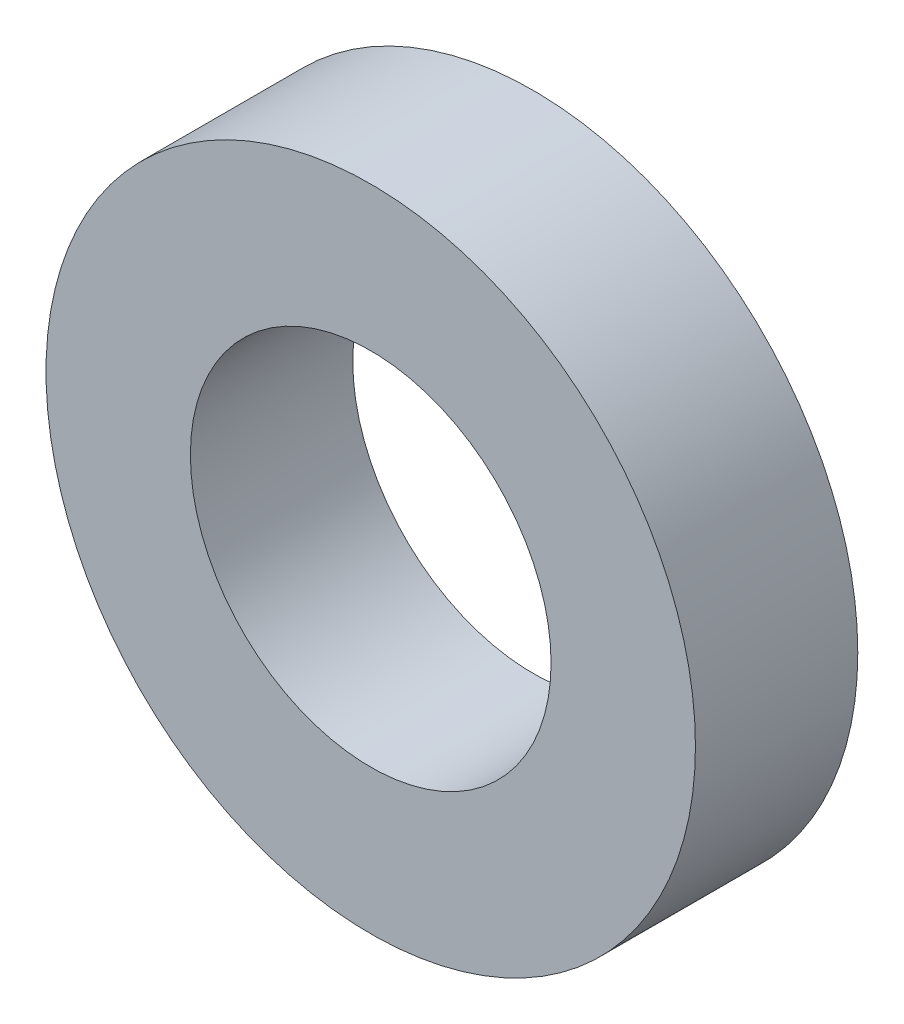
ISO-10303-21;
HEADER;
FILE_DESCRIPTION(('STEP AP214'),'2;1');
FILE_NAME('part.step','',(''),(''),'','','');
FILE_SCHEMA(('AUTOMOTIVE_DESIGN { 1 0 10303 214 1 1 1 1 }'));
ENDSEC;
DATA;
#1=APPLICATION_CONTEXT('core data for automotive mechanical design processes');
#2=APPLICATION_PROTOCOL_DEFINITION('international standard','automotive_design',2000,#1);
#3=PRODUCT_CONTEXT('',#1,'mechanical');
#4=PRODUCT('Part','Part','',(#3));
#5=PRODUCT_RELATED_PRODUCT_CATEGORY('part','',(#4));
#6=PRODUCT_DEFINITION_FORMATION('','',#4);
#7=PRODUCT_DEFINITION_CONTEXT('part definition',#1,'design');
#8=PRODUCT_DEFINITION('design','',#6,#7);
#9=PRODUCT_DEFINITION_SHAPE('','',#8);
#10=(LENGTH_UNIT() NAMED_UNIT(*) SI_UNIT(.MILLI.,.METRE.));
#11=(NAMED_UNIT(*) PLANE_ANGLE_UNIT() SI_UNIT($,.RADIAN.));
#12=(NAMED_UNIT(*) SI_UNIT($,.STERADIAN.) SOLID_ANGLE_UNIT());
#13=UNCERTAINTY_MEASURE_WITH_UNIT(LENGTH_MEASURE(1.E-05),#10,'distance_accuracy_value','');
#14=(GEOMETRIC_REPRESENTATION_CONTEXT(3) GLOBAL_UNCERTAINTY_ASSIGNED_CONTEXT((#13)) GLOBAL_UNIT_ASSIGNED_CONTEXT((#10,
#11,#12)) REPRESENTATION_CONTEXT('',''));
#15=CARTESIAN_POINT('',(0.,0.,0.));
#16=DIRECTION('',(0.,0.,1.));
#17=DIRECTION('',(1.,0.,0.));
#18=AXIS2_PLACEMENT_3D('',#15,#16,#17);
#19=CARTESIAN_POINT('',(0.,0.,50.));
#20=DIRECTION('',(0.,0.,-1.));
#21=DIRECTION('',(-1.,0.,0.));
#22=AXIS2_PLACEMENT_3D('',#19,#20,#21);
#23=CYLINDRICAL_SURFACE('',#22,100.);
#24=CARTESIAN_POINT('',(0.,0.,50.));
#25=DIRECTION('',(0.,0.,1.));
#26=DIRECTION('',(1.,0.,0.));
#27=AXIS2_PLACEMENT_3D('',#24,#25,#26);
#28=CIRCLE('',#27,100.);
#29=CARTESIAN_POINT('',(100.,0.,50.));
#30=VERTEX_POINT('',#29);
#31=EDGE_CURVE('E10',#30,#30,#28,.T.);
#32=ORIENTED_EDGE('',*,*,#31,.F.);
#33=EDGE_LOOP('',(#32));
#34=FACE_BOUND('',#33,.T.);
#35=CARTESIAN_POINT('',(0.,0.,0.));
#36=DIRECTION('',(0.,0.,1.));
#37=DIRECTION('',(1.,0.,0.));
#38=AXIS2_PLACEMENT_3D('',#35,#36,#37);
#39=CIRCLE('',#38,100.);
#40=CARTESIAN_POINT('',(100.,0.,0.));
#41=VERTEX_POINT('',#40);
#42=EDGE_CURVE('E34',#41,#41,#39,.T.);
#43=ORIENTED_EDGE('',*,*,#42,.T.);
#44=EDGE_LOOP('',(#43));
#45=FACE_BOUND('',#44,.T.);
#46=ADVANCED_FACE('F31',(#34,#45),#23,.T.);
#47=CARTESIAN_POINT('',(0.,0.,50.));
#48=DIRECTION('',(0.,0.,1.));
#49=DIRECTION('',(1.,0.,0.));
#50=AXIS2_PLACEMENT_3D('',#47,#48,#49);
#51=PLANE('',#50);
#52=CARTESIAN_POINT('',(0.,0.,50.));
#53=DIRECTION('',(0.,0.,1.));
#54=DIRECTION('',(1.,0.,0.));
#55=AXIS2_PLACEMENT_3D('',#52,#53,#54);
#56=CIRCLE('',#55,55.5382456145792);
#57=CARTESIAN_POINT('',(55.5382456145792,0.,50.));
#58=VERTEX_POINT('',#57);
#59=EDGE_CURVE('E43',#58,#58,#56,.T.);
#60=ORIENTED_EDGE('',*,*,#59,.F.);
#61=EDGE_LOOP('',(#60));
#62=FACE_BOUND('',#61,.T.);
#63=ORIENTED_EDGE('',*,*,#31,.T.);
#64=EDGE_LOOP('',(#63));
#65=FACE_BOUND('',#64,.T.);
#66=ADVANCED_FACE('F58',(#62,#65),#51,.T.);
#67=CARTESIAN_POINT('',(0.,0.,0.));
#68=DIRECTION('',(0.,0.,1.));
#69=DIRECTION('',(1.,0.,0.));
#70=AXIS2_PLACEMENT_3D('',#67,#68,#69);
#71=PLANE('',#70);
#72=CARTESIAN_POINT('',(0.,0.,0.));
#73=DIRECTION('',(0.,0.,1.));
#74=DIRECTION('',(1.,0.,0.));
#75=AXIS2_PLACEMENT_3D('',#72,#73,#74);
#76=CIRCLE('',#75,55.5382456145792);
#77=CARTESIAN_POINT('',(55.5382456145792,0.,0.));
#78=VERTEX_POINT('',#77);
#79=EDGE_CURVE('E41',#78,#78,#76,.T.);
#80=ORIENTED_EDGE('',*,*,#79,.T.);
#81=EDGE_LOOP('',(#80));
#82=FACE_BOUND('',#81,.T.);
#83=ORIENTED_EDGE('',*,*,#42,.F.);
#84=EDGE_LOOP('',(#83));
#85=FACE_BOUND('',#84,.T.);
#86=ADVANCED_FACE('F49',(#82,#85),#71,.F.);
#87=CARTESIAN_POINT('',(0.,0.,0.));
#88=DIRECTION('',(0.,0.,1.));
#89=DIRECTION('',(1.,0.,0.));
#90=AXIS2_PLACEMENT_3D('',#87,#88,#89);
#91=CYLINDRICAL_SURFACE('',#90,55.5382456145792);
#92=ORIENTED_EDGE('',*,*,#79,.F.);
#93=EDGE_LOOP('',(#92));
#94=FACE_BOUND('',#93,.T.);
#95=ORIENTED_EDGE('',*,*,#59,.T.);
#96=EDGE_LOOP('',(#95));
#97=FACE_BOUND('',#96,.T.);
#98=ADVANCED_FACE('F52',(#94,#97),#91,.F.);
#99=CLOSED_SHELL('',(#46,#66,#86,#98));
#100=MANIFOLD_SOLID_BREP('B2',#99);
#101=ADVANCED_BREP_SHAPE_REPRESENTATION('',(#18,#100),#14);
#102=SHAPE_DEFINITION_REPRESENTATION(#9,#101);
ENDSEC;
END-ISO-10303-21;
